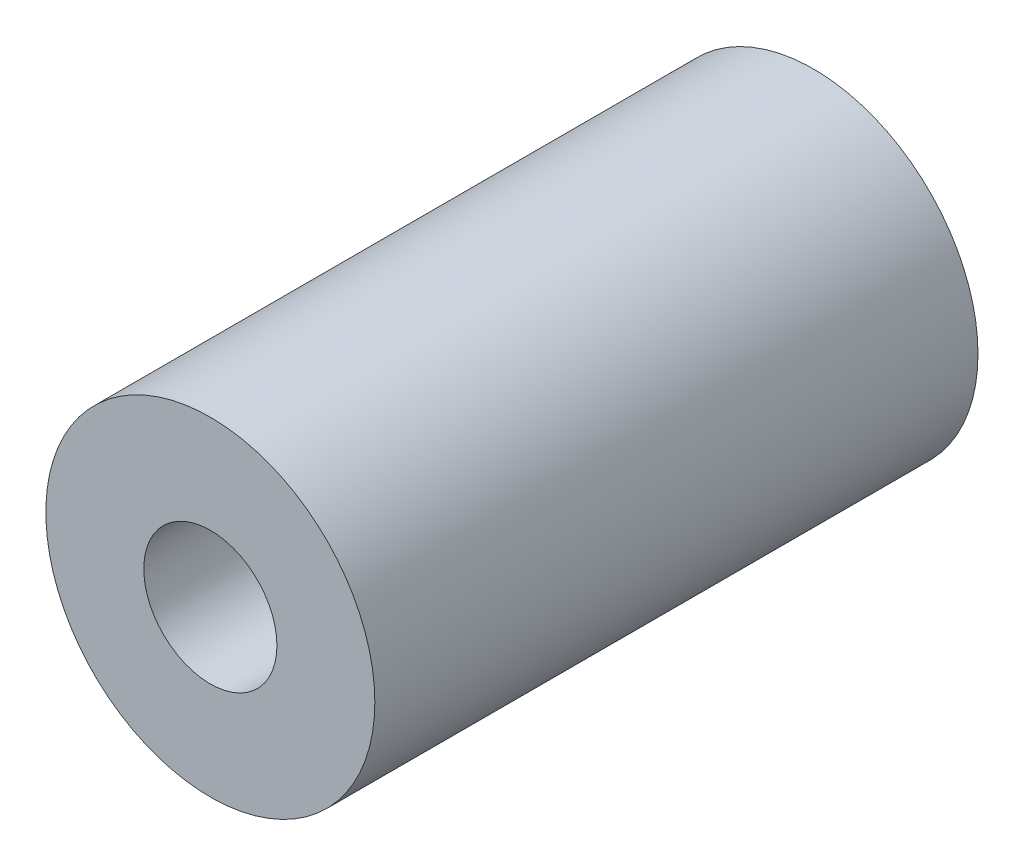
ISO-10303-21;
HEADER;
FILE_DESCRIPTION(('STEP AP214'),'2;1');
FILE_NAME('part.step','',(''),(''),'','','');
FILE_SCHEMA(('AUTOMOTIVE_DESIGN { 1 0 10303 214 1 1 1 1 }'));
ENDSEC;
DATA;
#1=APPLICATION_CONTEXT('core data for automotive mechanical design processes');
#2=APPLICATION_PROTOCOL_DEFINITION('international standard','automotive_design',2000,#1);
#3=PRODUCT_CONTEXT('',#1,'mechanical');
#4=PRODUCT('Part','Part','',(#3));
#5=PRODUCT_RELATED_PRODUCT_CATEGORY('part','',(#4));
#6=PRODUCT_DEFINITION_FORMATION('','',#4);
#7=PRODUCT_DEFINITION_CONTEXT('part definition',#1,'design');
#8=PRODUCT_DEFINITION('design','',#6,#7);
#9=PRODUCT_DEFINITION_SHAPE('','',#8);
#10=(LENGTH_UNIT() NAMED_UNIT(*) SI_UNIT(.MILLI.,.METRE.));
#11=(NAMED_UNIT(*) PLANE_ANGLE_UNIT() SI_UNIT($,.RADIAN.));
#12=(NAMED_UNIT(*) SI_UNIT($,.STERADIAN.) SOLID_ANGLE_UNIT());
#13=UNCERTAINTY_MEASURE_WITH_UNIT(LENGTH_MEASURE(1.E-05),#10,'distance_accuracy_value','');
#14=(GEOMETRIC_REPRESENTATION_CONTEXT(3) GLOBAL_UNCERTAINTY_ASSIGNED_CONTEXT((#13)) GLOBAL_UNIT_ASSIGNED_CONTEXT((#10,
#11,#12)) REPRESENTATION_CONTEXT('',''));
#15=CARTESIAN_POINT('',(0.,0.,0.));
#16=DIRECTION('',(0.,0.,1.));
#17=DIRECTION('',(1.,0.,0.));
#18=AXIS2_PLACEMENT_3D('',#15,#16,#17);
#19=CARTESIAN_POINT('',(0.,0.,0.));
#20=DIRECTION('',(0.,0.,1.));
#21=DIRECTION('',(1.,0.,0.));
#22=AXIS2_PLACEMENT_3D('',#19,#20,#21);
#23=CYLINDRICAL_SURFACE('',#22,5.25);
#24=CARTESIAN_POINT('',(0.,0.,19.75));
#25=DIRECTION('',(0.,0.,1.));
#26=DIRECTION('',(1.,0.,0.));
#27=AXIS2_PLACEMENT_3D('',#24,#25,#26);
#28=CIRCLE('',#27,5.25);
#29=CARTESIAN_POINT('',(5.25,0.,19.75));
#30=VERTEX_POINT('',#29);
#31=EDGE_CURVE('E44',#30,#30,#28,.T.);
#32=ORIENTED_EDGE('',*,*,#31,.F.);
#33=EDGE_LOOP('',(#32));
#34=FACE_BOUND('',#33,.T.);
#35=CARTESIAN_POINT('',(0.,0.,0.5));
#36=DIRECTION('',(0.,0.,-1.));
#37=DIRECTION('',(-1.,0.,0.));
#38=AXIS2_PLACEMENT_3D('',#35,#36,#37);
#39=CIRCLE('',#38,5.25);
#40=CARTESIAN_POINT('',(-5.25,0.,0.500000000000001));
#41=VERTEX_POINT('',#40);
#42=EDGE_CURVE('E52',#41,#41,#39,.T.);
#43=ORIENTED_EDGE('',*,*,#42,.F.);
#44=EDGE_LOOP('',(#43));
#45=FACE_BOUND('',#44,.T.);
#46=ADVANCED_FACE('F37',(#34,#45),#23,.T.);
#47=CARTESIAN_POINT('',(5.25,0.,0.));
#48=DIRECTION('',(0.,0.,-1.));
#49=DIRECTION('',(-1.,0.,0.));
#50=AXIS2_PLACEMENT_3D('',#47,#48,#49);
#51=PLANE('',#50);
#52=CARTESIAN_POINT('',(0.,0.,0.));
#53=DIRECTION('',(0.,0.,1.));
#54=DIRECTION('',(1.,0.,0.));
#55=AXIS2_PLACEMENT_3D('',#52,#53,#54);
#56=CIRCLE('',#55,2.125);
#57=CARTESIAN_POINT('',(2.125,0.,0.));
#58=VERTEX_POINT('',#57);
#59=EDGE_CURVE('E10',#58,#58,#56,.T.);
#60=ORIENTED_EDGE('',*,*,#59,.T.);
#61=EDGE_LOOP('',(#60));
#62=FACE_BOUND('',#61,.T.);
#63=CARTESIAN_POINT('',(0.,0.,0.));
#64=DIRECTION('',(0.,0.,-1.));
#65=DIRECTION('',(-1.,0.,0.));
#66=AXIS2_PLACEMENT_3D('',#63,#64,#65);
#67=CIRCLE('',#66,3.);
#68=CARTESIAN_POINT('',(-3.,0.,0.));
#69=VERTEX_POINT('',#68);
#70=EDGE_CURVE('E59',#69,#69,#67,.T.);
#71=ORIENTED_EDGE('',*,*,#70,.T.);
#72=EDGE_LOOP('',(#71));
#73=FACE_BOUND('',#72,.T.);
#74=ADVANCED_FACE('F76',(#62,#73),#51,.T.);
#75=CARTESIAN_POINT('',(0.,0.,0.));
#76=DIRECTION('',(0.,0.,1.));
#77=DIRECTION('',(1.,0.,0.));
#78=AXIS2_PLACEMENT_3D('',#75,#76,#77);
#79=CYLINDRICAL_SURFACE('',#78,2.125);
#80=ORIENTED_EDGE('',*,*,#59,.F.);
#81=EDGE_LOOP('',(#80));
#82=FACE_BOUND('',#81,.T.);
#83=CARTESIAN_POINT('',(0.,0.,19.75));
#84=DIRECTION('',(0.,0.,1.));
#85=DIRECTION('',(1.,0.,0.));
#86=AXIS2_PLACEMENT_3D('',#83,#84,#85);
#87=CIRCLE('',#86,2.125);
#88=CARTESIAN_POINT('',(2.125,0.,19.75));
#89=VERTEX_POINT('',#88);
#90=EDGE_CURVE('E48',#89,#89,#87,.T.);
#91=ORIENTED_EDGE('',*,*,#90,.T.);
#92=EDGE_LOOP('',(#91));
#93=FACE_BOUND('',#92,.T.);
#94=ADVANCED_FACE('F39',(#82,#93),#79,.F.);
#95=CARTESIAN_POINT('',(0.,0.,19.75));
#96=DIRECTION('',(0.,0.,1.));
#97=DIRECTION('',(1.,0.,0.));
#98=AXIS2_PLACEMENT_3D('',#95,#96,#97);
#99=PLANE('',#98);
#100=ORIENTED_EDGE('',*,*,#31,.T.);
#101=EDGE_LOOP('',(#100));
#102=FACE_BOUND('',#101,.T.);
#103=ORIENTED_EDGE('',*,*,#90,.F.);
#104=EDGE_LOOP('',(#103));
#105=FACE_BOUND('',#104,.T.);
#106=ADVANCED_FACE('F71',(#102,#105),#99,.T.);
#107=CARTESIAN_POINT('',(0.,0.,0.5));
#108=DIRECTION('',(0.,0.,-1.));
#109=DIRECTION('',(-1.,0.,0.));
#110=AXIS2_PLACEMENT_3D('',#107,#108,#109);
#111=PLANE('',#110);
#112=CARTESIAN_POINT('',(0.,0.,0.5));
#113=DIRECTION('',(0.,0.,-1.));
#114=DIRECTION('',(-1.,0.,0.));
#115=AXIS2_PLACEMENT_3D('',#112,#113,#114);
#116=CIRCLE('',#115,3.);
#117=CARTESIAN_POINT('',(-3.,0.,0.5));
#118=VERTEX_POINT('',#117);
#119=EDGE_CURVE('E58',#118,#118,#116,.T.);
#120=ORIENTED_EDGE('',*,*,#119,.F.);
#121=EDGE_LOOP('',(#120));
#122=FACE_BOUND('',#121,.T.);
#123=ORIENTED_EDGE('',*,*,#42,.T.);
#124=EDGE_LOOP('',(#123));
#125=FACE_BOUND('',#124,.T.);
#126=ADVANCED_FACE('F68',(#122,#125),#111,.T.);
#127=CARTESIAN_POINT('',(0.,0.,0.5));
#128=DIRECTION('',(0.,0.,-1.));
#129=DIRECTION('',(-1.,0.,0.));
#130=AXIS2_PLACEMENT_3D('',#127,#128,#129);
#131=CYLINDRICAL_SURFACE('',#130,3.);
#132=ORIENTED_EDGE('',*,*,#119,.T.);
#133=EDGE_LOOP('',(#132));
#134=FACE_BOUND('',#133,.T.);
#135=ORIENTED_EDGE('',*,*,#70,.F.);
#136=EDGE_LOOP('',(#135));
#137=FACE_BOUND('',#136,.T.);
#138=ADVANCED_FACE('F65',(#134,#137),#131,.T.);
#139=CLOSED_SHELL('',(#46,#74,#94,#106,#126,#138));
#140=MANIFOLD_SOLID_BREP('B2',#139);
#141=ADVANCED_BREP_SHAPE_REPRESENTATION('',(#18,#140),#14);
#142=SHAPE_DEFINITION_REPRESENTATION(#9,#141);
ENDSEC;
END-ISO-10303-21;
